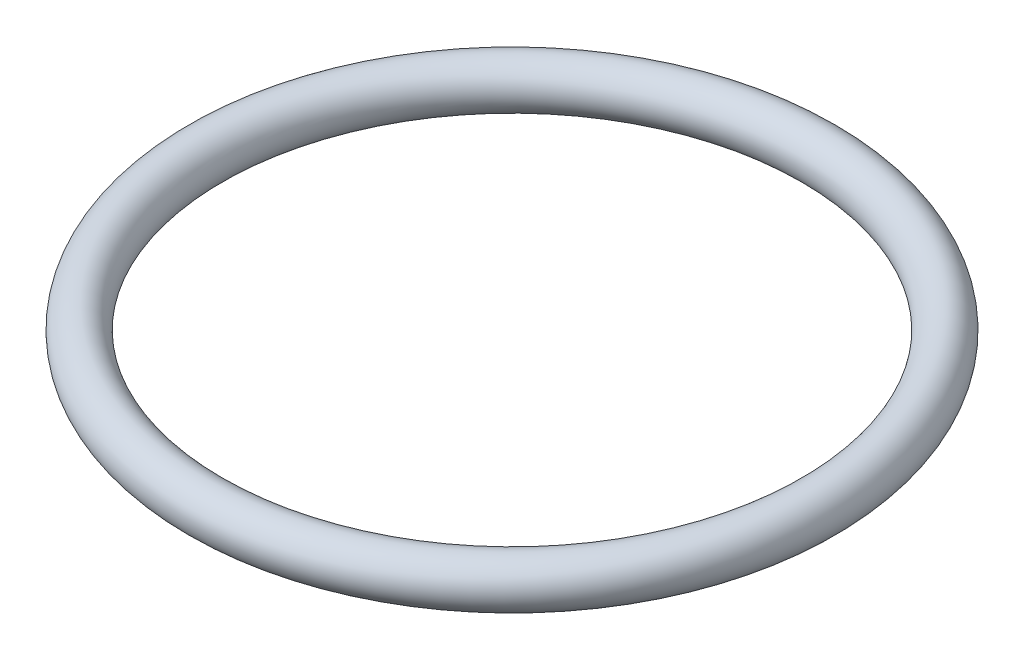
ISO-10303-21;
HEADER;
FILE_DESCRIPTION(('STEP AP214'),'2;1');
FILE_NAME('part.step','',(''),(''),'','','');
FILE_SCHEMA(('AUTOMOTIVE_DESIGN { 1 0 10303 214 1 1 1 1 }'));
ENDSEC;
DATA;
#1=APPLICATION_CONTEXT('core data for automotive mechanical design processes');
#2=APPLICATION_PROTOCOL_DEFINITION('international standard','automotive_design',2000,#1);
#3=PRODUCT_CONTEXT('',#1,'mechanical');
#4=PRODUCT('Part','Part','',(#3));
#5=PRODUCT_RELATED_PRODUCT_CATEGORY('part','',(#4));
#6=PRODUCT_DEFINITION_FORMATION('','',#4);
#7=PRODUCT_DEFINITION_CONTEXT('part definition',#1,'design');
#8=PRODUCT_DEFINITION('design','',#6,#7);
#9=PRODUCT_DEFINITION_SHAPE('','',#8);
#10=(LENGTH_UNIT() NAMED_UNIT(*) SI_UNIT(.MILLI.,.METRE.));
#11=(NAMED_UNIT(*) PLANE_ANGLE_UNIT() SI_UNIT($,.RADIAN.));
#12=(NAMED_UNIT(*) SI_UNIT($,.STERADIAN.) SOLID_ANGLE_UNIT());
#13=UNCERTAINTY_MEASURE_WITH_UNIT(LENGTH_MEASURE(1.E-05),#10,'distance_accuracy_value','');
#14=(GEOMETRIC_REPRESENTATION_CONTEXT(3) GLOBAL_UNCERTAINTY_ASSIGNED_CONTEXT((#13)) GLOBAL_UNIT_ASSIGNED_CONTEXT((#10,
#11,#12)) REPRESENTATION_CONTEXT('',''));
#15=CARTESIAN_POINT('',(0.,0.,0.));
#16=DIRECTION('',(0.,0.,1.));
#17=DIRECTION('',(1.,0.,0.));
#18=AXIS2_PLACEMENT_3D('',#15,#16,#17);
#19=CARTESIAN_POINT('',(0.,0.,0.));
#20=DIRECTION('',(0.,1.,0.));
#21=DIRECTION('',(0.,0.,1.));
#22=AXIS2_PLACEMENT_3D('',#19,#20,#21);
#23=TOROIDAL_SURFACE('',#22,26.125,2.);
#24=CARTESIAN_POINT('',(0.,0.,26.125));
#25=DIRECTION('',(1.,0.,0.));
#26=DIRECTION('',(0.,0.,-1.));
#27=AXIS2_PLACEMENT_3D('',#24,#25,#26);
#28=CIRCLE('',#27,2.);
#29=CARTESIAN_POINT('',(0.,0.,28.125));
#30=VERTEX_POINT('',#29);
#31=EDGE_CURVE('E11',#30,#30,#28,.T.);
#32=CARTESIAN_POINT('',(0.,0.,0.));
#33=DIRECTION('',(0.,1.,0.));
#34=DIRECTION('',(0.,0.,1.));
#35=AXIS2_PLACEMENT_3D('',#32,#33,#34);
#36=CIRCLE('',#35,28.125);
#37=EDGE_CURVE('',#30,#30,#36,.T.);
#38=ORIENTED_EDGE('',*,*,#31,.T.);
#39=ORIENTED_EDGE('',*,*,#31,.F.);
#40=ORIENTED_EDGE('',*,*,#37,.T.);
#41=ORIENTED_EDGE('',*,*,#37,.F.);
#42=EDGE_LOOP('',(#38,#40,#39,#41));
#43=FACE_BOUND('',#42,.T.);
#44=ADVANCED_FACE('F52',(#43),#23,.T.);
#45=CLOSED_SHELL('',(#44));
#46=MANIFOLD_SOLID_BREP('B2',#45);
#47=ADVANCED_BREP_SHAPE_REPRESENTATION('',(#18,#46),#14);
#48=SHAPE_DEFINITION_REPRESENTATION(#9,#47);
ENDSEC;
END-ISO-10303-21;
